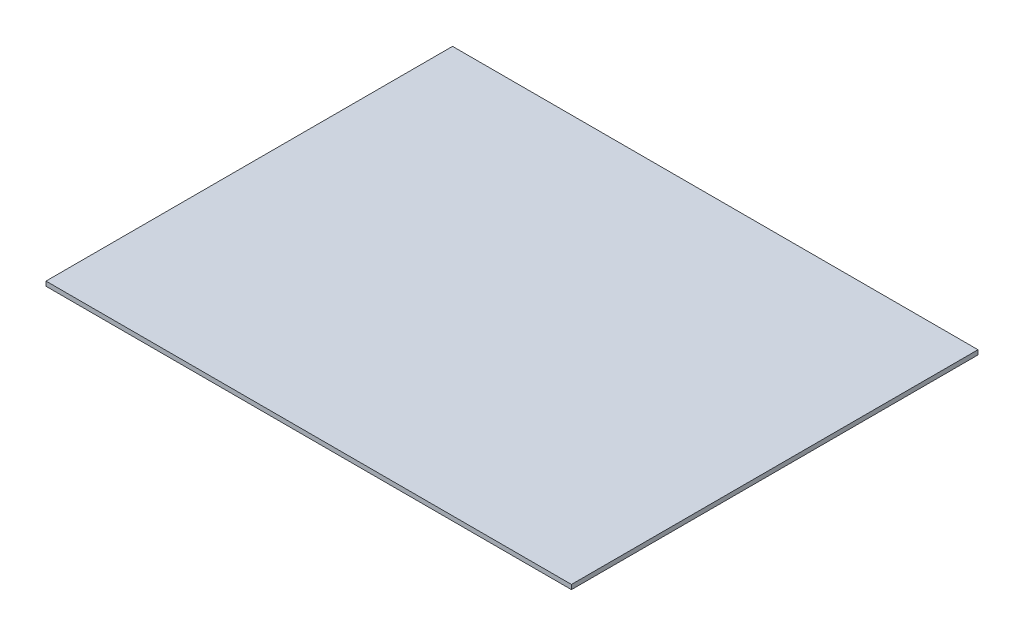
ISO-10303-21;
HEADER;
FILE_DESCRIPTION(('STEP AP214'),'2;1');
FILE_NAME('part.step','',(''),(''),'','','');
FILE_SCHEMA(('AUTOMOTIVE_DESIGN { 1 0 10303 214 1 1 1 1 }'));
ENDSEC;
DATA;
#1=APPLICATION_CONTEXT('core data for automotive mechanical design processes');
#2=APPLICATION_PROTOCOL_DEFINITION('international standard','automotive_design',2000,#1);
#3=PRODUCT_CONTEXT('',#1,'mechanical');
#4=PRODUCT('Part','Part','',(#3));
#5=PRODUCT_RELATED_PRODUCT_CATEGORY('part','',(#4));
#6=PRODUCT_DEFINITION_FORMATION('','',#4);
#7=PRODUCT_DEFINITION_CONTEXT('part definition',#1,'design');
#8=PRODUCT_DEFINITION('design','',#6,#7);
#9=PRODUCT_DEFINITION_SHAPE('','',#8);
#10=(LENGTH_UNIT() NAMED_UNIT(*) SI_UNIT(.MILLI.,.METRE.));
#11=(NAMED_UNIT(*) PLANE_ANGLE_UNIT() SI_UNIT($,.RADIAN.));
#12=(NAMED_UNIT(*) SI_UNIT($,.STERADIAN.) SOLID_ANGLE_UNIT());
#13=UNCERTAINTY_MEASURE_WITH_UNIT(LENGTH_MEASURE(1.E-05),#10,'distance_accuracy_value','');
#14=(GEOMETRIC_REPRESENTATION_CONTEXT(3) GLOBAL_UNCERTAINTY_ASSIGNED_CONTEXT((#13)) GLOBAL_UNIT_ASSIGNED_CONTEXT((#10,
#11,#12)) REPRESENTATION_CONTEXT('',''));
#15=CARTESIAN_POINT('',(0.,0.,0.));
#16=DIRECTION('',(0.,0.,1.));
#17=DIRECTION('',(1.,0.,0.));
#18=AXIS2_PLACEMENT_3D('',#15,#16,#17);
#19=CARTESIAN_POINT('',(232.,4.,179.5));
#20=DIRECTION('',(-1.,0.,0.));
#21=DIRECTION('',(0.,0.,1.));
#22=AXIS2_PLACEMENT_3D('',#19,#20,#21);
#23=PLANE('',#22);
#24=DIRECTION('',(0.,0.,-1.));
#25=VECTOR('',#24,1.);
#26=CARTESIAN_POINT('',(232.,0.,179.5));
#27=LINE('',#26,#25);
#28=CARTESIAN_POINT('',(232.,0.,179.5));
#29=VERTEX_POINT('',#28);
#30=CARTESIAN_POINT('',(232.,0.,-179.5));
#31=VERTEX_POINT('',#30);
#32=EDGE_CURVE('E98',#29,#31,#27,.T.);
#33=ORIENTED_EDGE('',*,*,#32,.T.);
#34=DIRECTION('',(0.,-1.,0.));
#35=VECTOR('',#34,1.);
#36=CARTESIAN_POINT('',(232.,4.,-179.5));
#37=LINE('',#36,#35);
#38=CARTESIAN_POINT('',(232.,4.,-179.5));
#39=VERTEX_POINT('',#38);
#40=EDGE_CURVE('E11',#39,#31,#37,.T.);
#41=ORIENTED_EDGE('',*,*,#40,.F.);
#42=DIRECTION('',(0.,0.,-1.));
#43=VECTOR('',#42,1.);
#44=CARTESIAN_POINT('',(232.,4.,179.5));
#45=LINE('',#44,#43);
#46=CARTESIAN_POINT('',(232.,4.,179.5));
#47=VERTEX_POINT('',#46);
#48=EDGE_CURVE('E86',#47,#39,#45,.T.);
#49=ORIENTED_EDGE('',*,*,#48,.F.);
#50=DIRECTION('',(0.,-1.,0.));
#51=VECTOR('',#50,1.);
#52=CARTESIAN_POINT('',(232.,4.,179.5));
#53=LINE('',#52,#51);
#54=EDGE_CURVE('E94',#47,#29,#53,.T.);
#55=ORIENTED_EDGE('',*,*,#54,.T.);
#56=EDGE_LOOP('',(#33,#41,#49,#55));
#57=FACE_BOUND('',#56,.T.);
#58=ADVANCED_FACE('F35',(#57),#23,.F.);
#59=CARTESIAN_POINT('',(-232.,4.,-179.5));
#60=DIRECTION('',(0.,0.,1.));
#61=DIRECTION('',(1.,0.,0.));
#62=AXIS2_PLACEMENT_3D('',#59,#60,#61);
#63=PLANE('',#62);
#64=DIRECTION('',(-1.,0.,0.));
#65=VECTOR('',#64,1.);
#66=CARTESIAN_POINT('',(-232.,0.,-179.5));
#67=LINE('',#66,#65);
#68=CARTESIAN_POINT('',(-232.,0.,-179.5));
#69=VERTEX_POINT('',#68);
#70=EDGE_CURVE('E90',#31,#69,#67,.T.);
#71=ORIENTED_EDGE('',*,*,#70,.T.);
#72=DIRECTION('',(0.,-1.,0.));
#73=VECTOR('',#72,1.);
#74=CARTESIAN_POINT('',(-232.,4.,-179.5));
#75=LINE('',#74,#73);
#76=CARTESIAN_POINT('',(-232.,4.,-179.5));
#77=VERTEX_POINT('',#76);
#78=EDGE_CURVE('E43',#77,#69,#75,.T.);
#79=ORIENTED_EDGE('',*,*,#78,.F.);
#80=DIRECTION('',(-1.,0.,0.));
#81=VECTOR('',#80,1.);
#82=CARTESIAN_POINT('',(-232.,4.,-179.5));
#83=LINE('',#82,#81);
#84=EDGE_CURVE('E81',#39,#77,#83,.T.);
#85=ORIENTED_EDGE('',*,*,#84,.F.);
#86=ORIENTED_EDGE('',*,*,#40,.T.);
#87=EDGE_LOOP('',(#71,#79,#85,#86));
#88=FACE_BOUND('',#87,.T.);
#89=ADVANCED_FACE('F89',(#88),#63,.F.);
#90=CARTESIAN_POINT('',(-232.,4.,179.5));
#91=DIRECTION('',(1.,0.,0.));
#92=DIRECTION('',(0.,0.,-1.));
#93=AXIS2_PLACEMENT_3D('',#90,#91,#92);
#94=PLANE('',#93);
#95=DIRECTION('',(0.,0.,1.));
#96=VECTOR('',#95,1.);
#97=CARTESIAN_POINT('',(-232.,0.,179.5));
#98=LINE('',#97,#96);
#99=CARTESIAN_POINT('',(-232.,0.,179.5));
#100=VERTEX_POINT('',#99);
#101=EDGE_CURVE('E68',#69,#100,#98,.T.);
#102=ORIENTED_EDGE('',*,*,#101,.T.);
#103=DIRECTION('',(0.,-1.,0.));
#104=VECTOR('',#103,1.);
#105=CARTESIAN_POINT('',(-232.,4.,179.5));
#106=LINE('',#105,#104);
#107=CARTESIAN_POINT('',(-232.,4.,179.5));
#108=VERTEX_POINT('',#107);
#109=EDGE_CURVE('E91',#108,#100,#106,.T.);
#110=ORIENTED_EDGE('',*,*,#109,.F.);
#111=DIRECTION('',(0.,0.,1.));
#112=VECTOR('',#111,1.);
#113=CARTESIAN_POINT('',(-232.,4.,179.5));
#114=LINE('',#113,#112);
#115=EDGE_CURVE('E84',#77,#108,#114,.T.);
#116=ORIENTED_EDGE('',*,*,#115,.F.);
#117=ORIENTED_EDGE('',*,*,#78,.T.);
#118=EDGE_LOOP('',(#102,#110,#116,#117));
#119=FACE_BOUND('',#118,.T.);
#120=ADVANCED_FACE('F92',(#119),#94,.F.);
#121=CARTESIAN_POINT('',(-232.,4.,179.5));
#122=DIRECTION('',(0.,0.,-1.));
#123=DIRECTION('',(-1.,0.,0.));
#124=AXIS2_PLACEMENT_3D('',#121,#122,#123);
#125=PLANE('',#124);
#126=DIRECTION('',(1.,0.,0.));
#127=VECTOR('',#126,1.);
#128=CARTESIAN_POINT('',(-232.,0.,179.5));
#129=LINE('',#128,#127);
#130=EDGE_CURVE('E74',#100,#29,#129,.T.);
#131=ORIENTED_EDGE('',*,*,#130,.T.);
#132=ORIENTED_EDGE('',*,*,#54,.F.);
#133=DIRECTION('',(1.,0.,0.));
#134=VECTOR('',#133,1.);
#135=CARTESIAN_POINT('',(-232.,4.,179.5));
#136=LINE('',#135,#134);
#137=EDGE_CURVE('E51',#108,#47,#136,.T.);
#138=ORIENTED_EDGE('',*,*,#137,.F.);
#139=ORIENTED_EDGE('',*,*,#109,.T.);
#140=EDGE_LOOP('',(#131,#132,#138,#139));
#141=FACE_BOUND('',#140,.T.);
#142=ADVANCED_FACE('F105',(#141),#125,.F.);
#143=CARTESIAN_POINT('',(0.,4.,0.));
#144=DIRECTION('',(0.,-1.,0.));
#145=DIRECTION('',(0.,0.,-1.));
#146=AXIS2_PLACEMENT_3D('',#143,#144,#145);
#147=PLANE('',#146);
#148=ORIENTED_EDGE('',*,*,#48,.T.);
#149=ORIENTED_EDGE('',*,*,#84,.T.);
#150=ORIENTED_EDGE('',*,*,#115,.T.);
#151=ORIENTED_EDGE('',*,*,#137,.T.);
#152=EDGE_LOOP('',(#148,#149,#150,#151));
#153=FACE_BOUND('',#152,.T.);
#154=ADVANCED_FACE('F82',(#153),#147,.F.);
#155=CARTESIAN_POINT('',(0.,0.,0.));
#156=DIRECTION('',(0.,-1.,0.));
#157=DIRECTION('',(0.,0.,-1.));
#158=AXIS2_PLACEMENT_3D('',#155,#156,#157);
#159=PLANE('',#158);
#160=ORIENTED_EDGE('',*,*,#32,.F.);
#161=ORIENTED_EDGE('',*,*,#130,.F.);
#162=ORIENTED_EDGE('',*,*,#101,.F.);
#163=ORIENTED_EDGE('',*,*,#70,.F.);
#164=EDGE_LOOP('',(#160,#161,#162,#163));
#165=FACE_BOUND('',#164,.T.);
#166=ADVANCED_FACE('F108',(#165),#159,.T.);
#167=CLOSED_SHELL('',(#58,#89,#120,#142,#154,#166));
#168=MANIFOLD_SOLID_BREP('B2',#167);
#169=ADVANCED_BREP_SHAPE_REPRESENTATION('',(#18,#168),#14);
#170=SHAPE_DEFINITION_REPRESENTATION(#9,#169);
ENDSEC;
END-ISO-10303-21;
